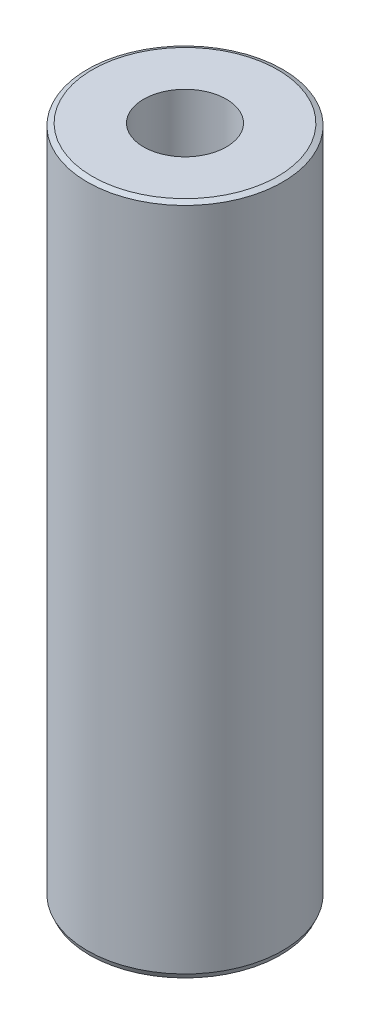
ISO-10303-21;
HEADER;
FILE_DESCRIPTION(('STEP AP214'),'2;1');
FILE_NAME('part.step','',(''),(''),'','','');
FILE_SCHEMA(('AUTOMOTIVE_DESIGN { 1 0 10303 214 1 1 1 1 }'));
ENDSEC;
DATA;
#1=APPLICATION_CONTEXT('core data for automotive mechanical design processes');
#2=APPLICATION_PROTOCOL_DEFINITION('international standard','automotive_design',2000,#1);
#3=PRODUCT_CONTEXT('',#1,'mechanical');
#4=PRODUCT('Part','Part','',(#3));
#5=PRODUCT_RELATED_PRODUCT_CATEGORY('part','',(#4));
#6=PRODUCT_DEFINITION_FORMATION('','',#4);
#7=PRODUCT_DEFINITION_CONTEXT('part definition',#1,'design');
#8=PRODUCT_DEFINITION('design','',#6,#7);
#9=PRODUCT_DEFINITION_SHAPE('','',#8);
#10=(LENGTH_UNIT() NAMED_UNIT(*) SI_UNIT(.MILLI.,.METRE.));
#11=(NAMED_UNIT(*) PLANE_ANGLE_UNIT() SI_UNIT($,.RADIAN.));
#12=(NAMED_UNIT(*) SI_UNIT($,.STERADIAN.) SOLID_ANGLE_UNIT());
#13=UNCERTAINTY_MEASURE_WITH_UNIT(LENGTH_MEASURE(1.E-05),#10,'distance_accuracy_value','');
#14=(GEOMETRIC_REPRESENTATION_CONTEXT(3) GLOBAL_UNCERTAINTY_ASSIGNED_CONTEXT((#13)) GLOBAL_UNIT_ASSIGNED_CONTEXT((#10,
#11,#12)) REPRESENTATION_CONTEXT('',''));
#15=CARTESIAN_POINT('',(0.,0.,0.));
#16=DIRECTION('',(0.,0.,1.));
#17=DIRECTION('',(1.,0.,0.));
#18=AXIS2_PLACEMENT_3D('',#15,#16,#17);
#19=CARTESIAN_POINT('',(0.,189.476186639234,0.));
#20=DIRECTION('',(0.,-1.,0.));
#21=DIRECTION('',(0.,0.,-1.));
#22=AXIS2_PLACEMENT_3D('',#19,#20,#21);
#23=CYLINDRICAL_SURFACE('',#22,27.5);
#24=CARTESIAN_POINT('',(0.,188.827374355162,0.));
#25=DIRECTION('',(0.,1.,0.));
#26=DIRECTION('',(0.,0.,1.));
#27=AXIS2_PLACEMENT_3D('',#24,#25,#26);
#28=CIRCLE('',#27,27.5);
#29=CARTESIAN_POINT('',(0.,188.827374355162,27.5));
#30=VERTEX_POINT('',#29);
#31=EDGE_CURVE('E50',#30,#30,#28,.F.);
#32=ORIENTED_EDGE('',*,*,#31,.T.);
#33=EDGE_LOOP('',(#32));
#34=FACE_BOUND('',#33,.T.);
#35=CARTESIAN_POINT('',(0.,1.43268795519569,0.));
#36=DIRECTION('',(0.,1.,0.));
#37=DIRECTION('',(0.,0.,1.));
#38=AXIS2_PLACEMENT_3D('',#35,#36,#37);
#39=CIRCLE('',#38,27.5);
#40=CARTESIAN_POINT('',(0.,1.43268795519569,27.5));
#41=VERTEX_POINT('',#40);
#42=EDGE_CURVE('E51',#41,#41,#39,.T.);
#43=ORIENTED_EDGE('',*,*,#42,.T.);
#44=EDGE_LOOP('',(#43));
#45=FACE_BOUND('',#44,.T.);
#46=ADVANCED_FACE('F39',(#34,#45),#23,.T.);
#47=CARTESIAN_POINT('',(0.,189.476186639234,0.));
#48=DIRECTION('',(0.,1.,0.));
#49=DIRECTION('',(0.,0.,1.));
#50=AXIS2_PLACEMENT_3D('',#47,#48,#49);
#51=PLANE('',#50);
#52=CARTESIAN_POINT('',(0.,189.476186639234,0.));
#53=DIRECTION('',(0.,1.,0.));
#54=DIRECTION('',(0.,0.,1.));
#55=AXIS2_PLACEMENT_3D('',#52,#53,#54);
#56=CIRCLE('',#55,26.0673120448041);
#57=CARTESIAN_POINT('',(0.,189.476186639234,26.0673120448041));
#58=VERTEX_POINT('',#57);
#59=EDGE_CURVE('E54',#58,#58,#56,.T.);
#60=ORIENTED_EDGE('',*,*,#59,.T.);
#61=EDGE_LOOP('',(#60));
#62=FACE_BOUND('',#61,.T.);
#63=CARTESIAN_POINT('',(0.,189.476186639234,0.));
#64=DIRECTION('',(0.,1.,0.));
#65=DIRECTION('',(0.,0.,1.));
#66=AXIS2_PLACEMENT_3D('',#63,#64,#65);
#67=CIRCLE('',#66,11.6585185124535);
#68=CARTESIAN_POINT('',(0.,189.476186639234,11.6585185124535));
#69=VERTEX_POINT('',#68);
#70=EDGE_CURVE('E58',#69,#69,#67,.T.);
#71=ORIENTED_EDGE('',*,*,#70,.F.);
#72=EDGE_LOOP('',(#71));
#73=FACE_BOUND('',#72,.T.);
#74=ADVANCED_FACE('F69',(#62,#73),#51,.T.);
#75=CARTESIAN_POINT('',(0.,0.,0.));
#76=DIRECTION('',(0.,1.,0.));
#77=DIRECTION('',(0.,0.,1.));
#78=AXIS2_PLACEMENT_3D('',#75,#76,#77);
#79=PLANE('',#78);
#80=CARTESIAN_POINT('',(0.,0.,0.));
#81=DIRECTION('',(0.,1.,0.));
#82=DIRECTION('',(0.,0.,1.));
#83=AXIS2_PLACEMENT_3D('',#80,#81,#82);
#84=CIRCLE('',#83,26.8511877159282);
#85=CARTESIAN_POINT('',(0.,0.,26.8511877159282));
#86=VERTEX_POINT('',#85);
#87=EDGE_CURVE('E10',#86,#86,#84,.F.);
#88=ORIENTED_EDGE('',*,*,#87,.T.);
#89=EDGE_LOOP('',(#88));
#90=FACE_BOUND('',#89,.T.);
#91=CARTESIAN_POINT('',(0.,0.,0.));
#92=DIRECTION('',(0.,1.,0.));
#93=DIRECTION('',(0.,0.,1.));
#94=AXIS2_PLACEMENT_3D('',#91,#92,#93);
#95=CIRCLE('',#94,11.6585185124535);
#96=CARTESIAN_POINT('',(0.,0.,11.6585185124535));
#97=VERTEX_POINT('',#96);
#98=EDGE_CURVE('E63',#97,#97,#95,.T.);
#99=ORIENTED_EDGE('',*,*,#98,.T.);
#100=EDGE_LOOP('',(#99));
#101=FACE_BOUND('',#100,.T.);
#102=ADVANCED_FACE('F75',(#90,#101),#79,.F.);
#103=CARTESIAN_POINT('',(0.,189.476186639234,0.));
#104=DIRECTION('',(0.,-1.,0.));
#105=DIRECTION('',(0.,0.,-1.));
#106=AXIS2_PLACEMENT_3D('',#103,#104,#105);
#107=CYLINDRICAL_SURFACE('',#106,11.6585185124535);
#108=ORIENTED_EDGE('',*,*,#70,.T.);
#109=EDGE_LOOP('',(#108));
#110=FACE_BOUND('',#109,.T.);
#111=ORIENTED_EDGE('',*,*,#98,.F.);
#112=EDGE_LOOP('',(#111));
#113=FACE_BOUND('',#112,.T.);
#114=ADVANCED_FACE('F70',(#110,#113),#107,.F.);
#115=CARTESIAN_POINT('',(0.,189.476186639234,0.));
#116=DIRECTION('',(0.,-1.,0.));
#117=DIRECTION('',(0.,0.,-1.));
#118=AXIS2_PLACEMENT_3D('',#115,#116,#117);
#119=CONICAL_SURFACE('',#118,26.0673120448041,1.14556354801986);
#120=ORIENTED_EDGE('',*,*,#31,.F.);
#121=EDGE_LOOP('',(#120));
#122=FACE_BOUND('',#121,.T.);
#123=ORIENTED_EDGE('',*,*,#59,.F.);
#124=EDGE_LOOP('',(#123));
#125=FACE_BOUND('',#124,.T.);
#126=ADVANCED_FACE('F81',(#122,#125),#119,.T.);
#127=CARTESIAN_POINT('',(0.,1.43268795519569,0.));
#128=DIRECTION('',(0.,1.,0.));
#129=DIRECTION('',(0.,0.,1.));
#130=AXIS2_PLACEMENT_3D('',#127,#128,#129);
#131=CONICAL_SURFACE('',#130,27.5,0.42523277877503);
#132=ORIENTED_EDGE('',*,*,#87,.F.);
#133=EDGE_LOOP('',(#132));
#134=FACE_BOUND('',#133,.T.);
#135=ORIENTED_EDGE('',*,*,#42,.F.);
#136=EDGE_LOOP('',(#135));
#137=FACE_BOUND('',#136,.T.);
#138=ADVANCED_FACE('F45',(#134,#137),#131,.T.);
#139=CLOSED_SHELL('',(#46,#74,#102,#114,#126,#138));
#140=MANIFOLD_SOLID_BREP('B2',#139);
#141=ADVANCED_BREP_SHAPE_REPRESENTATION('',(#18,#140),#14);
#142=SHAPE_DEFINITION_REPRESENTATION(#9,#141);
ENDSEC;
END-ISO-10303-21;
